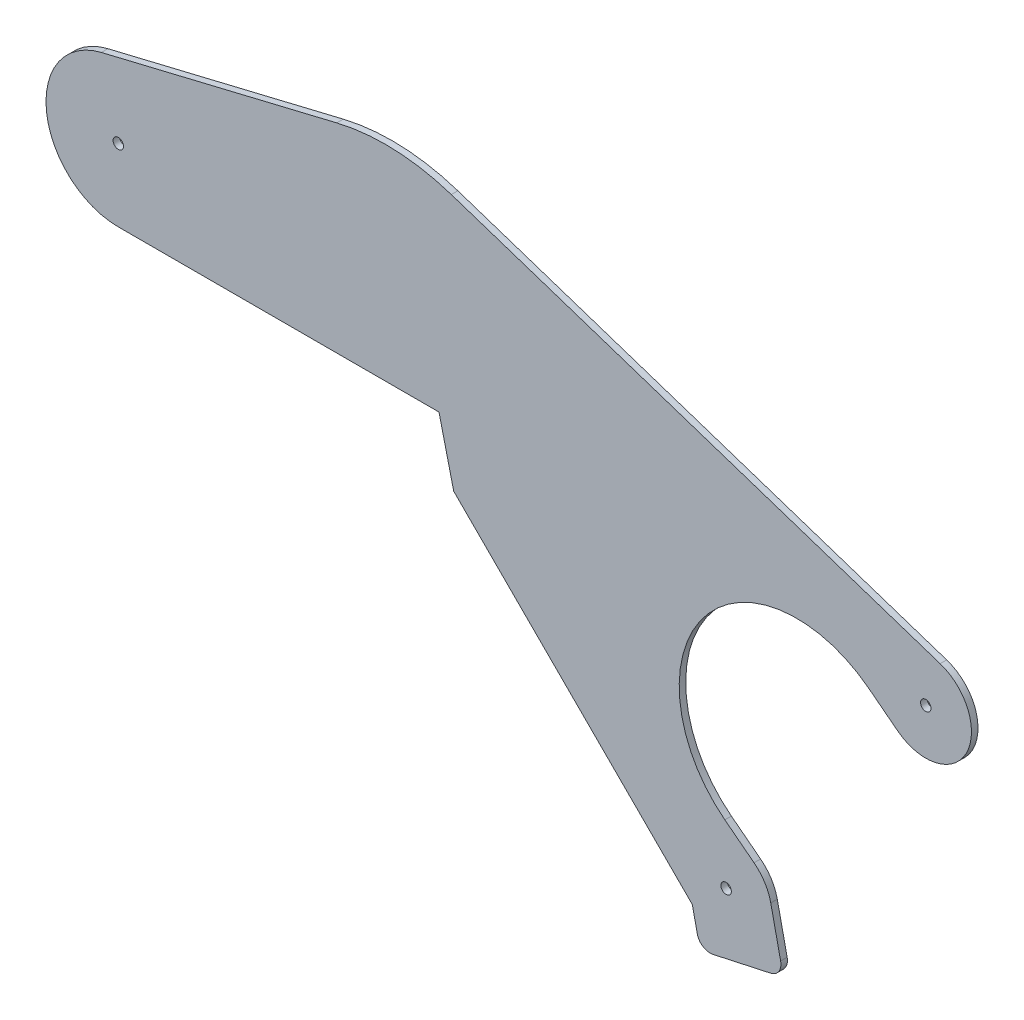
ISO-10303-21;
HEADER;
FILE_DESCRIPTION(('STEP AP214'),'2;1');
FILE_NAME('part.step','',(''),(''),'','','');
FILE_SCHEMA(('AUTOMOTIVE_DESIGN { 1 0 10303 214 1 1 1 1 }'));
ENDSEC;
DATA;
#1=APPLICATION_CONTEXT('core data for automotive mechanical design processes');
#2=APPLICATION_PROTOCOL_DEFINITION('international standard','automotive_design',2000,#1);
#3=PRODUCT_CONTEXT('',#1,'mechanical');
#4=PRODUCT('Part','Part','',(#3));
#5=PRODUCT_RELATED_PRODUCT_CATEGORY('part','',(#4));
#6=PRODUCT_DEFINITION_FORMATION('','',#4);
#7=PRODUCT_DEFINITION_CONTEXT('part definition',#1,'design');
#8=PRODUCT_DEFINITION('design','',#6,#7);
#9=PRODUCT_DEFINITION_SHAPE('','',#8);
#10=(LENGTH_UNIT() NAMED_UNIT(*) SI_UNIT(.MILLI.,.METRE.));
#11=(NAMED_UNIT(*) PLANE_ANGLE_UNIT() SI_UNIT($,.RADIAN.));
#12=(NAMED_UNIT(*) SI_UNIT($,.STERADIAN.) SOLID_ANGLE_UNIT());
#13=UNCERTAINTY_MEASURE_WITH_UNIT(LENGTH_MEASURE(1.E-05),#10,'distance_accuracy_value','');
#14=(GEOMETRIC_REPRESENTATION_CONTEXT(3) GLOBAL_UNCERTAINTY_ASSIGNED_CONTEXT((#13)) GLOBAL_UNIT_ASSIGNED_CONTEXT((#10,
#11,#12)) REPRESENTATION_CONTEXT('',''));
#15=CARTESIAN_POINT('',(0.,0.,0.));
#16=DIRECTION('',(0.,0.,1.));
#17=DIRECTION('',(1.,0.,0.));
#18=AXIS2_PLACEMENT_3D('',#15,#16,#17);
#19=CARTESIAN_POINT('',(295.571537134259,49.9390985922286,3.175));
#20=DIRECTION('',(0.,0.,1.));
#21=DIRECTION('',(1.,0.,0.));
#22=AXIS2_PLACEMENT_3D('',#19,#20,#21);
#23=PLANE('',#22);
#24=CARTESIAN_POINT('',(0.,215.9,3.175));
#25=DIRECTION('',(0.,0.,1.));
#26=DIRECTION('',(1.,0.,0.));
#27=AXIS2_PLACEMENT_3D('',#24,#25,#26);
#28=CIRCLE('',#27,2.54000000000001);
#29=CARTESIAN_POINT('',(2.54000000000001,215.9,3.175));
#30=VERTEX_POINT('',#29);
#31=EDGE_CURVE('E415',#30,#30,#28,.T.);
#32=ORIENTED_EDGE('',*,*,#31,.F.);
#33=EDGE_LOOP('',(#32));
#34=FACE_BOUND('',#33,.T.);
#35=CARTESIAN_POINT('',(295.571537134259,49.9390985922286,3.175));
#36=DIRECTION('',(0.,0.,1.));
#37=DIRECTION('',(1.,0.,0.));
#38=AXIS2_PLACEMENT_3D('',#35,#36,#37);
#39=CIRCLE('',#38,22.2249999999999);
#40=CARTESIAN_POINT('',(317.287210274764,54.6698665060856,3.175));
#41=VERTEX_POINT('',#40);
#42=CARTESIAN_POINT('',(309.165828872801,67.5216426950431,3.175));
#43=VERTEX_POINT('',#42);
#44=EDGE_CURVE('E253',#41,#43,#39,.T.);
#45=ORIENTED_EDGE('',*,*,#44,.T.);
#46=DIRECTION('',(-0.791115595177258,0.611666669900635,0.));
#47=VECTOR('',#46,1.);
#48=CARTESIAN_POINT('',(309.165828872801,67.5216426950431,3.175));
#49=LINE('',#48,#47);
#50=CARTESIAN_POINT('',(294.956987540673,78.5074894079018,3.175));
#51=VERTEX_POINT('',#50);
#52=EDGE_CURVE('E133',#43,#51,#49,.T.);
#53=ORIENTED_EDGE('',*,*,#52,.T.);
#54=CARTESIAN_POINT('',(329.913737725494,123.719745672282,3.175));
#55=DIRECTION('',(0.,0.,-1.));
#56=DIRECTION('',(-1.,0.,0.));
#57=AXIS2_PLACEMENT_3D('',#54,#55,#56);
#58=CIRCLE('',#57,57.15);
#59=CARTESIAN_POINT('',(364.870487910316,168.932001936662,3.175));
#60=VERTEX_POINT('',#59);
#61=EDGE_CURVE('E310',#51,#60,#58,.T.);
#62=ORIENTED_EDGE('',*,*,#61,.T.);
#63=DIRECTION('',(0.791115595177258,-0.611666669900635,0.));
#64=VECTOR('',#63,1.);
#65=CARTESIAN_POINT('',(364.870487910316,168.932001936662,3.175));
#66=LINE('',#65,#64);
#67=CARTESIAN_POINT('',(379.079329242443,157.946155223804,3.175));
#68=VERTEX_POINT('',#67);
#69=EDGE_CURVE('E330',#60,#68,#66,.T.);
#70=ORIENTED_EDGE('',*,*,#69,.T.);
#71=CARTESIAN_POINT('',(392.673620980985,175.528699326618,3.175));
#72=DIRECTION('',(0.,0.,1.));
#73=DIRECTION('',(1.,0.,0.));
#74=AXIS2_PLACEMENT_3D('',#71,#72,#73);
#75=CIRCLE('',#74,22.2250000000002);
#76=CARTESIAN_POINT('',(399.659420331189,196.627259287874,3.175));
#77=VERTEX_POINT('',#76);
#78=EDGE_CURVE('E326',#68,#77,#75,.T.);
#79=ORIENTED_EDGE('',*,*,#78,.T.);
#80=DIRECTION('',(-0.949316533689792,0.314321680549081,0.));
#81=VECTOR('',#80,1.);
#82=CARTESIAN_POINT('',(161.950324223875,275.333486261341,3.175));
#83=LINE('',#82,#81);
#84=CARTESIAN_POINT('',(161.950324223875,275.333486261341,3.175));
#85=VERTEX_POINT('',#84);
#86=EDGE_CURVE('E329',#77,#85,#83,.T.);
#87=ORIENTED_EDGE('',*,*,#86,.T.);
#88=CARTESIAN_POINT('',(130.015241480089,178.882926438458,3.175));
#89=DIRECTION('',(0.,0.,1.));
#90=DIRECTION('',(-1.,0.,0.));
#91=AXIS2_PLACEMENT_3D('',#88,#89,#90);
#92=CIRCLE('',#91,101.6);
#93=CARTESIAN_POINT('',(106.22673095449,277.658767447146,3.175));
#94=VERTEX_POINT('',#93);
#95=EDGE_CURVE('E334',#85,#94,#92,.T.);
#96=ORIENTED_EDGE('',*,*,#95,.T.);
#97=DIRECTION('',(-0.972203159534325,-0.234138883125967,0.));
#98=VECTOR('',#97,1.);
#99=CARTESIAN_POINT('',(-8.23472555890414,250.092638571516,3.175));
#100=LINE('',#99,#98);
#101=CARTESIAN_POINT('',(-8.23472555890414,250.092638571516,3.175));
#102=VERTEX_POINT('',#101);
#103=EDGE_CURVE('E341',#94,#102,#100,.T.);
#104=ORIENTED_EDGE('',*,*,#103,.T.);
#105=CARTESIAN_POINT('',(0.,215.9,3.175));
#106=DIRECTION('',(0.,0.,1.));
#107=DIRECTION('',(1.,0.,0.));
#108=AXIS2_PLACEMENT_3D('',#105,#106,#107);
#109=CIRCLE('',#108,35.1702606972539);
#110=CARTESIAN_POINT('',(0.,180.729739302746,3.175));
#111=VERTEX_POINT('',#110);
#112=EDGE_CURVE('E344',#102,#111,#109,.T.);
#113=ORIENTED_EDGE('',*,*,#112,.T.);
#114=DIRECTION('',(1.,0.,0.));
#115=VECTOR('',#114,1.);
#116=CARTESIAN_POINT('',(0.,180.729739302746,3.175));
#117=LINE('',#116,#115);
#118=CARTESIAN_POINT('',(155.941245852293,180.729739302746,3.175));
#119=VERTEX_POINT('',#118);
#120=EDGE_CURVE('E347',#111,#119,#117,.T.);
#121=ORIENTED_EDGE('',*,*,#120,.T.);
#122=DIRECTION('',(0.234138883126223,-0.972203159534264,0.));
#123=VECTOR('',#122,1.);
#124=CARTESIAN_POINT('',(155.941245852293,180.729739302746,3.175));
#125=LINE('',#124,#123);
#126=CARTESIAN_POINT('',(163.107951031453,150.971788271293,3.175));
#127=VERTEX_POINT('',#126);
#128=EDGE_CURVE('E350',#119,#127,#125,.T.);
#129=ORIENTED_EDGE('',*,*,#128,.T.);
#130=DIRECTION('',(0.707106781186547,-0.707106781186548,0.));
#131=VECTOR('',#130,1.);
#132=CARTESIAN_POINT('',(163.107951031453,150.971788271293,3.175));
#133=LINE('',#132,#131);
#134=CARTESIAN_POINT('',(279.140387861661,34.939351441085,3.175));
#135=VERTEX_POINT('',#134);
#136=EDGE_CURVE('E353',#127,#135,#133,.T.);
#137=ORIENTED_EDGE('',*,*,#136,.T.);
#138=DIRECTION('',(0.21285794887996,-0.977083155928203,0.));
#139=VECTOR('',#138,1.);
#140=CARTESIAN_POINT('',(279.140387861661,34.939351441085,3.175));
#141=LINE('',#140,#139);
#142=CARTESIAN_POINT('',(281.571044282355,23.781894277723,3.175));
#143=VERTEX_POINT('',#142);
#144=EDGE_CURVE('E356',#135,#143,#141,.T.);
#145=ORIENTED_EDGE('',*,*,#144,.T.);
#146=CARTESIAN_POINT('',(287.775522322499,25.1335422531107,3.175));
#147=DIRECTION('',(0.,0.,1.));
#148=DIRECTION('',(1.,0.,0.));
#149=AXIS2_PLACEMENT_3D('',#146,#147,#148);
#150=CIRCLE('',#149,6.34999999999993);
#151=CARTESIAN_POINT('',(289.127170297887,18.9290642129667,3.175));
#152=VERTEX_POINT('',#151);
#153=EDGE_CURVE('E179',#143,#152,#150,.T.);
#154=ORIENTED_EDGE('',*,*,#153,.T.);
#155=DIRECTION('',(0.977083155928205,0.212857948879947,0.));
#156=VECTOR('',#155,1.);
#157=CARTESIAN_POINT('',(289.127170297887,18.9290642129667,3.175));
#158=LINE('',#157,#156);
#159=CARTESIAN_POINT('',(317.240211958058,25.0535013688563,3.175));
#160=VERTEX_POINT('',#159);
#161=EDGE_CURVE('E173',#152,#160,#158,.T.);
#162=ORIENTED_EDGE('',*,*,#161,.T.);
#163=CARTESIAN_POINT('',(315.888563982671,31.2579794090003,3.175));
#164=DIRECTION('',(0.,0.,1.));
#165=DIRECTION('',(1.,0.,0.));
#166=AXIS2_PLACEMENT_3D('',#163,#164,#165);
#167=CIRCLE('',#166,6.34999999999997);
#168=CARTESIAN_POINT('',(322.093042022815,32.6096273843879,3.175));
#169=VERTEX_POINT('',#168);
#170=EDGE_CURVE('E177',#160,#169,#167,.T.);
#171=ORIENTED_EDGE('',*,*,#170,.T.);
#172=DIRECTION('',(-0.212857948879952,0.977083155928204,0.));
#173=VECTOR('',#172,1.);
#174=CARTESIAN_POINT('',(322.093042022815,32.6096273843879,3.175));
#175=LINE('',#174,#173);
#176=EDGE_CURVE('E63',#169,#41,#175,.T.);
#177=ORIENTED_EDGE('',*,*,#176,.T.);
#178=EDGE_LOOP('',(#45,#53,#62,#70,#79,#87,#96,#104,#113,#121,#129,#137,#145,#154,#162,#171,#177));
#179=FACE_BOUND('',#178,.T.);
#180=CARTESIAN_POINT('',(295.571537134259,49.9390985922286,3.175));
#181=DIRECTION('',(0.,0.,1.));
#182=DIRECTION('',(1.,0.,0.));
#183=AXIS2_PLACEMENT_3D('',#180,#181,#182);
#184=CIRCLE('',#183,2.54000000000053);
#185=CARTESIAN_POINT('',(298.11153713426,49.9390985922286,3.175));
#186=VERTEX_POINT('',#185);
#187=EDGE_CURVE('E206',#186,#186,#184,.T.);
#188=ORIENTED_EDGE('',*,*,#187,.F.);
#189=EDGE_LOOP('',(#188));
#190=FACE_BOUND('',#189,.T.);
#191=CARTESIAN_POINT('',(392.673620980985,175.528699326618,3.175));
#192=DIRECTION('',(0.,0.,1.));
#193=DIRECTION('',(1.,0.,0.));
#194=AXIS2_PLACEMENT_3D('',#191,#192,#193);
#195=CIRCLE('',#194,2.53999999999922);
#196=CARTESIAN_POINT('',(395.213620980984,175.528699326618,3.175));
#197=VERTEX_POINT('',#196);
#198=EDGE_CURVE('E404',#197,#197,#195,.T.);
#199=ORIENTED_EDGE('',*,*,#198,.F.);
#200=EDGE_LOOP('',(#199));
#201=FACE_BOUND('',#200,.T.);
#202=ADVANCED_FACE('F45',(#34,#179,#190,#201),#23,.T.);
#203=CARTESIAN_POINT('',(295.571537134259,49.9390985922286,0.));
#204=DIRECTION('',(0.,0.,1.));
#205=DIRECTION('',(1.,0.,0.));
#206=AXIS2_PLACEMENT_3D('',#203,#204,#205);
#207=PLANE('',#206);
#208=CARTESIAN_POINT('',(295.571537134259,49.9390985922286,0.));
#209=DIRECTION('',(0.,0.,1.));
#210=DIRECTION('',(1.,0.,0.));
#211=AXIS2_PLACEMENT_3D('',#208,#209,#210);
#212=CIRCLE('',#211,22.2249999999999);
#213=CARTESIAN_POINT('',(317.287210274764,54.6698665060856,0.));
#214=VERTEX_POINT('',#213);
#215=CARTESIAN_POINT('',(309.165828872801,67.5216426950431,0.));
#216=VERTEX_POINT('',#215);
#217=EDGE_CURVE('E201',#214,#216,#212,.T.);
#218=ORIENTED_EDGE('',*,*,#217,.F.);
#219=DIRECTION('',(-0.212857948879952,0.977083155928204,0.));
#220=VECTOR('',#219,1.);
#221=CARTESIAN_POINT('',(322.093042022815,32.6096273843879,0.));
#222=LINE('',#221,#220);
#223=CARTESIAN_POINT('',(322.093042022815,32.6096273843879,0.));
#224=VERTEX_POINT('',#223);
#225=EDGE_CURVE('E125',#224,#214,#222,.T.);
#226=ORIENTED_EDGE('',*,*,#225,.F.);
#227=CARTESIAN_POINT('',(315.888563982671,31.2579794090003,0.));
#228=DIRECTION('',(0.,0.,1.));
#229=DIRECTION('',(1.,0.,0.));
#230=AXIS2_PLACEMENT_3D('',#227,#228,#229);
#231=CIRCLE('',#230,6.34999999999997);
#232=CARTESIAN_POINT('',(317.240211958058,25.0535013688563,0.));
#233=VERTEX_POINT('',#232);
#234=EDGE_CURVE('E119',#233,#224,#231,.T.);
#235=ORIENTED_EDGE('',*,*,#234,.F.);
#236=DIRECTION('',(0.977083155928205,0.212857948879947,0.));
#237=VECTOR('',#236,1.);
#238=CARTESIAN_POINT('',(289.127170297887,18.9290642129667,0.));
#239=LINE('',#238,#237);
#240=CARTESIAN_POINT('',(289.127170297887,18.9290642129667,0.));
#241=VERTEX_POINT('',#240);
#242=EDGE_CURVE('E188',#241,#233,#239,.T.);
#243=ORIENTED_EDGE('',*,*,#242,.F.);
#244=CARTESIAN_POINT('',(287.775522322499,25.1335422531107,0.));
#245=DIRECTION('',(0.,0.,1.));
#246=DIRECTION('',(1.,0.,0.));
#247=AXIS2_PLACEMENT_3D('',#244,#245,#246);
#248=CIRCLE('',#247,6.34999999999993);
#249=CARTESIAN_POINT('',(281.571044282355,23.781894277723,0.));
#250=VERTEX_POINT('',#249);
#251=EDGE_CURVE('E244',#250,#241,#248,.T.);
#252=ORIENTED_EDGE('',*,*,#251,.F.);
#253=DIRECTION('',(0.21285794887996,-0.977083155928203,0.));
#254=VECTOR('',#253,1.);
#255=CARTESIAN_POINT('',(279.140387861661,34.939351441085,0.));
#256=LINE('',#255,#254);
#257=CARTESIAN_POINT('',(279.140387861661,34.939351441085,0.));
#258=VERTEX_POINT('',#257);
#259=EDGE_CURVE('E241',#258,#250,#256,.T.);
#260=ORIENTED_EDGE('',*,*,#259,.F.);
#261=DIRECTION('',(0.707106781186549,-0.707106781186546,0.));
#262=VECTOR('',#261,1.);
#263=CARTESIAN_POINT('',(267.156088922388,46.9236503803579,0.));
#264=LINE('',#263,#262);
#265=CARTESIAN_POINT('',(163.107951031453,150.971788271293,0.));
#266=VERTEX_POINT('',#265);
#267=EDGE_CURVE('E238',#266,#258,#264,.T.);
#268=ORIENTED_EDGE('',*,*,#267,.F.);
#269=DIRECTION('',(0.234138883126223,-0.972203159534264,0.));
#270=VECTOR('',#269,1.);
#271=CARTESIAN_POINT('',(155.941245852293,180.729739302746,0.));
#272=LINE('',#271,#270);
#273=CARTESIAN_POINT('',(155.941245852293,180.729739302746,0.));
#274=VERTEX_POINT('',#273);
#275=EDGE_CURVE('E234',#274,#266,#272,.T.);
#276=ORIENTED_EDGE('',*,*,#275,.F.);
#277=DIRECTION('',(1.,0.,0.));
#278=VECTOR('',#277,1.);
#279=CARTESIAN_POINT('',(91.265902062906,180.729739302746,0.));
#280=LINE('',#279,#278);
#281=CARTESIAN_POINT('',(0.,180.729739302746,0.));
#282=VERTEX_POINT('',#281);
#283=EDGE_CURVE('E231',#282,#274,#280,.T.);
#284=ORIENTED_EDGE('',*,*,#283,.F.);
#285=CARTESIAN_POINT('',(0.,215.9,0.));
#286=DIRECTION('',(0.,0.,1.));
#287=DIRECTION('',(1.,0.,0.));
#288=AXIS2_PLACEMENT_3D('',#285,#286,#287);
#289=CIRCLE('',#288,35.1702606972539);
#290=CARTESIAN_POINT('',(-8.23472555890414,250.092638571516,0.));
#291=VERTEX_POINT('',#290);
#292=EDGE_CURVE('E227',#291,#282,#289,.T.);
#293=ORIENTED_EDGE('',*,*,#292,.F.);
#294=DIRECTION('',(-0.972203159534325,-0.234138883125967,0.));
#295=VECTOR('',#294,1.);
#296=CARTESIAN_POINT('',(-8.23472555890414,250.092638571516,0.));
#297=LINE('',#296,#295);
#298=CARTESIAN_POINT('',(106.22673095449,277.658767447146,0.));
#299=VERTEX_POINT('',#298);
#300=EDGE_CURVE('E224',#299,#291,#297,.T.);
#301=ORIENTED_EDGE('',*,*,#300,.F.);
#302=CARTESIAN_POINT('',(130.015241480089,178.882926438458,0.));
#303=DIRECTION('',(0.,0.,1.));
#304=DIRECTION('',(-1.,0.,0.));
#305=AXIS2_PLACEMENT_3D('',#302,#303,#304);
#306=CIRCLE('',#305,101.6);
#307=CARTESIAN_POINT('',(161.950324223875,275.333486261341,0.));
#308=VERTEX_POINT('',#307);
#309=EDGE_CURVE('E221',#308,#299,#306,.T.);
#310=ORIENTED_EDGE('',*,*,#309,.F.);
#311=DIRECTION('',(-0.949316533689792,0.314321680549081,0.));
#312=VECTOR('',#311,1.);
#313=CARTESIAN_POINT('',(161.950324223875,275.333486261341,0.));
#314=LINE('',#313,#312);
#315=CARTESIAN_POINT('',(399.659420331189,196.627259287874,0.));
#316=VERTEX_POINT('',#315);
#317=EDGE_CURVE('E218',#316,#308,#314,.T.);
#318=ORIENTED_EDGE('',*,*,#317,.F.);
#319=CARTESIAN_POINT('',(392.673620980985,175.528699326618,0.));
#320=DIRECTION('',(0.,0.,1.));
#321=DIRECTION('',(1.,0.,0.));
#322=AXIS2_PLACEMENT_3D('',#319,#320,#321);
#323=CIRCLE('',#322,22.2250000000002);
#324=CARTESIAN_POINT('',(379.079329242443,157.946155223804,0.));
#325=VERTEX_POINT('',#324);
#326=EDGE_CURVE('E215',#325,#316,#323,.T.);
#327=ORIENTED_EDGE('',*,*,#326,.F.);
#328=DIRECTION('',(0.791115595177258,-0.611666669900635,0.));
#329=VECTOR('',#328,1.);
#330=CARTESIAN_POINT('',(364.870487910316,168.932001936662,0.));
#331=LINE('',#330,#329);
#332=CARTESIAN_POINT('',(364.870487910316,168.932001936662,0.));
#333=VERTEX_POINT('',#332);
#334=EDGE_CURVE('E212',#333,#325,#331,.T.);
#335=ORIENTED_EDGE('',*,*,#334,.F.);
#336=CARTESIAN_POINT('',(329.913737725494,123.719745672282,0.));
#337=DIRECTION('',(0.,0.,-1.));
#338=DIRECTION('',(-1.,0.,0.));
#339=AXIS2_PLACEMENT_3D('',#336,#337,#338);
#340=CIRCLE('',#339,57.15);
#341=CARTESIAN_POINT('',(294.956987540673,78.5074894079018,0.));
#342=VERTEX_POINT('',#341);
#343=EDGE_CURVE('E209',#342,#333,#340,.T.);
#344=ORIENTED_EDGE('',*,*,#343,.F.);
#345=DIRECTION('',(-0.791115595177258,0.611666669900635,0.));
#346=VECTOR('',#345,1.);
#347=CARTESIAN_POINT('',(309.165828872801,67.5216426950431,0.));
#348=LINE('',#347,#346);
#349=EDGE_CURVE('E205',#216,#342,#348,.T.);
#350=ORIENTED_EDGE('',*,*,#349,.F.);
#351=EDGE_LOOP('',(#218,#226,#235,#243,#252,#260,#268,#276,#284,#293,#301,#310,#318,#327,#335,
#344,#350));
#352=FACE_BOUND('',#351,.T.);
#353=CARTESIAN_POINT('',(295.571537134259,49.9390985922286,0.));
#354=DIRECTION('',(0.,0.,1.));
#355=DIRECTION('',(1.,0.,0.));
#356=AXIS2_PLACEMENT_3D('',#353,#354,#355);
#357=CIRCLE('',#356,2.54000000000053);
#358=CARTESIAN_POINT('',(298.11153713426,49.9390985922286,0.));
#359=VERTEX_POINT('',#358);
#360=EDGE_CURVE('E419',#359,#359,#357,.T.);
#361=ORIENTED_EDGE('',*,*,#360,.T.);
#362=EDGE_LOOP('',(#361));
#363=FACE_BOUND('',#362,.T.);
#364=CARTESIAN_POINT('',(0.,215.9,0.));
#365=DIRECTION('',(0.,0.,1.));
#366=DIRECTION('',(1.,0.,0.));
#367=AXIS2_PLACEMENT_3D('',#364,#365,#366);
#368=CIRCLE('',#367,2.54000000000001);
#369=CARTESIAN_POINT('',(2.54000000000001,215.9,0.));
#370=VERTEX_POINT('',#369);
#371=EDGE_CURVE('E412',#370,#370,#368,.T.);
#372=ORIENTED_EDGE('',*,*,#371,.T.);
#373=EDGE_LOOP('',(#372));
#374=FACE_BOUND('',#373,.T.);
#375=CARTESIAN_POINT('',(392.673620980985,175.528699326618,0.));
#376=DIRECTION('',(0.,0.,1.));
#377=DIRECTION('',(1.,0.,0.));
#378=AXIS2_PLACEMENT_3D('',#375,#376,#377);
#379=CIRCLE('',#378,2.53999999999922);
#380=CARTESIAN_POINT('',(395.213620980984,175.528699326618,0.));
#381=VERTEX_POINT('',#380);
#382=EDGE_CURVE('E407',#381,#381,#379,.T.);
#383=ORIENTED_EDGE('',*,*,#382,.T.);
#384=EDGE_LOOP('',(#383));
#385=FACE_BOUND('',#384,.T.);
#386=ADVANCED_FACE('F314',(#352,#363,#374,#385),#207,.F.);
#387=CARTESIAN_POINT('',(295.571537134259,49.9390985922286,3.175));
#388=DIRECTION('',(0.,0.,-1.));
#389=DIRECTION('',(-1.,0.,0.));
#390=AXIS2_PLACEMENT_3D('',#387,#388,#389);
#391=CYLINDRICAL_SURFACE('',#390,22.2249999999999);
#392=ORIENTED_EDGE('',*,*,#217,.T.);
#393=DIRECTION('',(0.,0.,-1.));
#394=VECTOR('',#393,1.);
#395=CARTESIAN_POINT('',(309.165828872801,67.5216426950431,3.175));
#396=LINE('',#395,#394);
#397=EDGE_CURVE('E11',#43,#216,#396,.T.);
#398=ORIENTED_EDGE('',*,*,#397,.F.);
#399=ORIENTED_EDGE('',*,*,#44,.F.);
#400=DIRECTION('',(0.,0.,-1.));
#401=VECTOR('',#400,1.);
#402=CARTESIAN_POINT('',(317.287210274764,54.6698665060856,3.175));
#403=LINE('',#402,#401);
#404=EDGE_CURVE('E197',#41,#214,#403,.T.);
#405=ORIENTED_EDGE('',*,*,#404,.T.);
#406=EDGE_LOOP('',(#392,#398,#399,#405));
#407=FACE_BOUND('',#406,.T.);
#408=ADVANCED_FACE('F47',(#407),#391,.T.);
#409=CARTESIAN_POINT('',(309.165828872801,67.5216426950431,3.175));
#410=DIRECTION('',(-0.611666669900635,-0.791115595177258,0.));
#411=DIRECTION('',(0.791115595177258,-0.611666669900635,0.));
#412=AXIS2_PLACEMENT_3D('',#409,#410,#411);
#413=PLANE('',#412);
#414=ORIENTED_EDGE('',*,*,#349,.T.);
#415=DIRECTION('',(0.,0.,-1.));
#416=VECTOR('',#415,1.);
#417=CARTESIAN_POINT('',(294.956987540673,78.5074894079018,3.175));
#418=LINE('',#417,#416);
#419=EDGE_CURVE('E55',#51,#342,#418,.T.);
#420=ORIENTED_EDGE('',*,*,#419,.F.);
#421=ORIENTED_EDGE('',*,*,#52,.F.);
#422=ORIENTED_EDGE('',*,*,#397,.T.);
#423=EDGE_LOOP('',(#414,#420,#421,#422));
#424=FACE_BOUND('',#423,.T.);
#425=ADVANCED_FACE('F572',(#424),#413,.F.);
#426=CARTESIAN_POINT('',(329.913737725494,123.719745672282,3.175));
#427=DIRECTION('',(0.,0.,-1.));
#428=DIRECTION('',(-1.,0.,0.));
#429=AXIS2_PLACEMENT_3D('',#426,#427,#428);
#430=CYLINDRICAL_SURFACE('',#429,57.15);
#431=ORIENTED_EDGE('',*,*,#343,.T.);
#432=DIRECTION('',(0.,0.,-1.));
#433=VECTOR('',#432,1.);
#434=CARTESIAN_POINT('',(364.870487910316,168.932001936662,3.175));
#435=LINE('',#434,#433);
#436=EDGE_CURVE('E300',#60,#333,#435,.T.);
#437=ORIENTED_EDGE('',*,*,#436,.F.);
#438=ORIENTED_EDGE('',*,*,#61,.F.);
#439=ORIENTED_EDGE('',*,*,#419,.T.);
#440=EDGE_LOOP('',(#431,#437,#438,#439));
#441=FACE_BOUND('',#440,.T.);
#442=ADVANCED_FACE('F308',(#441),#430,.F.);
#443=CARTESIAN_POINT('',(364.870487910316,168.932001936662,3.175));
#444=DIRECTION('',(0.611666669900636,0.791115595177258,0.));
#445=DIRECTION('',(-0.791115595177258,0.611666669900636,0.));
#446=AXIS2_PLACEMENT_3D('',#443,#444,#445);
#447=PLANE('',#446);
#448=ORIENTED_EDGE('',*,*,#334,.T.);
#449=DIRECTION('',(0.,0.,-1.));
#450=VECTOR('',#449,1.);
#451=CARTESIAN_POINT('',(379.079329242443,157.946155223804,3.175));
#452=LINE('',#451,#450);
#453=EDGE_CURVE('E296',#68,#325,#452,.T.);
#454=ORIENTED_EDGE('',*,*,#453,.F.);
#455=ORIENTED_EDGE('',*,*,#69,.F.);
#456=ORIENTED_EDGE('',*,*,#436,.T.);
#457=EDGE_LOOP('',(#448,#454,#455,#456));
#458=FACE_BOUND('',#457,.T.);
#459=ADVANCED_FACE('F320',(#458),#447,.F.);
#460=CARTESIAN_POINT('',(392.673620980985,175.528699326618,3.175));
#461=DIRECTION('',(0.,0.,-1.));
#462=DIRECTION('',(-1.,0.,0.));
#463=AXIS2_PLACEMENT_3D('',#460,#461,#462);
#464=CYLINDRICAL_SURFACE('',#463,22.2250000000002);
#465=ORIENTED_EDGE('',*,*,#326,.T.);
#466=DIRECTION('',(0.,0.,-1.));
#467=VECTOR('',#466,1.);
#468=CARTESIAN_POINT('',(399.659420331189,196.627259287874,3.175));
#469=LINE('',#468,#467);
#470=EDGE_CURVE('E292',#77,#316,#469,.T.);
#471=ORIENTED_EDGE('',*,*,#470,.F.);
#472=ORIENTED_EDGE('',*,*,#78,.F.);
#473=ORIENTED_EDGE('',*,*,#453,.T.);
#474=EDGE_LOOP('',(#465,#471,#472,#473));
#475=FACE_BOUND('',#474,.T.);
#476=ADVANCED_FACE('F324',(#475),#464,.T.);
#477=CARTESIAN_POINT('',(161.950324223875,275.333486261341,3.175));
#478=DIRECTION('',(-0.314321680549081,-0.949316533689792,0.));
#479=DIRECTION('',(0.949316533689792,-0.314321680549081,0.));
#480=AXIS2_PLACEMENT_3D('',#477,#478,#479);
#481=PLANE('',#480);
#482=ORIENTED_EDGE('',*,*,#317,.T.);
#483=DIRECTION('',(0.,0.,-1.));
#484=VECTOR('',#483,1.);
#485=CARTESIAN_POINT('',(161.950324223875,275.333486261341,3.175));
#486=LINE('',#485,#484);
#487=EDGE_CURVE('E288',#85,#308,#486,.T.);
#488=ORIENTED_EDGE('',*,*,#487,.F.);
#489=ORIENTED_EDGE('',*,*,#86,.F.);
#490=ORIENTED_EDGE('',*,*,#470,.T.);
#491=EDGE_LOOP('',(#482,#488,#489,#490));
#492=FACE_BOUND('',#491,.T.);
#493=ADVANCED_FACE('F541',(#492),#481,.F.);
#494=CARTESIAN_POINT('',(130.015241480089,178.882926438458,3.175));
#495=DIRECTION('',(0.,0.,-1.));
#496=DIRECTION('',(-1.,0.,0.));
#497=AXIS2_PLACEMENT_3D('',#494,#495,#496);
#498=CYLINDRICAL_SURFACE('',#497,101.6);
#499=ORIENTED_EDGE('',*,*,#309,.T.);
#500=DIRECTION('',(0.,0.,-1.));
#501=VECTOR('',#500,1.);
#502=CARTESIAN_POINT('',(106.22673095449,277.658767447146,3.175));
#503=LINE('',#502,#501);
#504=EDGE_CURVE('E284',#94,#299,#503,.T.);
#505=ORIENTED_EDGE('',*,*,#504,.F.);
#506=ORIENTED_EDGE('',*,*,#95,.F.);
#507=ORIENTED_EDGE('',*,*,#487,.T.);
#508=EDGE_LOOP('',(#499,#505,#506,#507));
#509=FACE_BOUND('',#508,.T.);
#510=ADVANCED_FACE('F532',(#509),#498,.T.);
#511=CARTESIAN_POINT('',(-8.23472555890414,250.092638571516,3.175));
#512=DIRECTION('',(0.234138883125967,-0.972203159534325,0.));
#513=DIRECTION('',(0.972203159534325,0.234138883125967,0.));
#514=AXIS2_PLACEMENT_3D('',#511,#512,#513);
#515=PLANE('',#514);
#516=ORIENTED_EDGE('',*,*,#300,.T.);
#517=DIRECTION('',(0.,0.,-1.));
#518=VECTOR('',#517,1.);
#519=CARTESIAN_POINT('',(-8.23472555890414,250.092638571516,3.175));
#520=LINE('',#519,#518);
#521=EDGE_CURVE('E280',#102,#291,#520,.T.);
#522=ORIENTED_EDGE('',*,*,#521,.F.);
#523=ORIENTED_EDGE('',*,*,#103,.F.);
#524=ORIENTED_EDGE('',*,*,#504,.T.);
#525=EDGE_LOOP('',(#516,#522,#523,#524));
#526=FACE_BOUND('',#525,.T.);
#527=ADVANCED_FACE('F523',(#526),#515,.F.);
#528=CARTESIAN_POINT('',(0.,215.9,3.175));
#529=DIRECTION('',(0.,0.,-1.));
#530=DIRECTION('',(-1.,0.,0.));
#531=AXIS2_PLACEMENT_3D('',#528,#529,#530);
#532=CYLINDRICAL_SURFACE('',#531,35.1702606972539);
#533=ORIENTED_EDGE('',*,*,#292,.T.);
#534=DIRECTION('',(0.,0.,-1.));
#535=VECTOR('',#534,1.);
#536=CARTESIAN_POINT('',(0.,180.729739302746,3.175));
#537=LINE('',#536,#535);
#538=EDGE_CURVE('E276',#111,#282,#537,.T.);
#539=ORIENTED_EDGE('',*,*,#538,.F.);
#540=ORIENTED_EDGE('',*,*,#112,.F.);
#541=ORIENTED_EDGE('',*,*,#521,.T.);
#542=EDGE_LOOP('',(#533,#539,#540,#541));
#543=FACE_BOUND('',#542,.T.);
#544=ADVANCED_FACE('F514',(#543),#532,.T.);
#545=CARTESIAN_POINT('',(91.265902062906,180.729739302746,3.175));
#546=DIRECTION('',(0.,1.,0.));
#547=DIRECTION('',(0.,0.,1.));
#548=AXIS2_PLACEMENT_3D('',#545,#546,#547);
#549=PLANE('',#548);
#550=ORIENTED_EDGE('',*,*,#283,.T.);
#551=DIRECTION('',(0.,0.,-1.));
#552=VECTOR('',#551,1.);
#553=CARTESIAN_POINT('',(155.941245852293,180.729739302746,3.175));
#554=LINE('',#553,#552);
#555=EDGE_CURVE('E272',#119,#274,#554,.T.);
#556=ORIENTED_EDGE('',*,*,#555,.F.);
#557=ORIENTED_EDGE('',*,*,#120,.F.);
#558=ORIENTED_EDGE('',*,*,#538,.T.);
#559=EDGE_LOOP('',(#550,#556,#557,#558));
#560=FACE_BOUND('',#559,.T.);
#561=ADVANCED_FACE('F505',(#560),#549,.F.);
#562=CARTESIAN_POINT('',(155.941245852293,180.729739302746,3.175));
#563=DIRECTION('',(0.972203159534264,0.234138883126223,0.));
#564=DIRECTION('',(-0.234138883126223,0.972203159534264,0.));
#565=AXIS2_PLACEMENT_3D('',#562,#563,#564);
#566=PLANE('',#565);
#567=ORIENTED_EDGE('',*,*,#275,.T.);
#568=DIRECTION('',(0.,0.,-1.));
#569=VECTOR('',#568,1.);
#570=CARTESIAN_POINT('',(163.107951031453,150.971788271293,3.175));
#571=LINE('',#570,#569);
#572=EDGE_CURVE('E268',#127,#266,#571,.T.);
#573=ORIENTED_EDGE('',*,*,#572,.F.);
#574=ORIENTED_EDGE('',*,*,#128,.F.);
#575=ORIENTED_EDGE('',*,*,#555,.T.);
#576=EDGE_LOOP('',(#567,#573,#574,#575));
#577=FACE_BOUND('',#576,.T.);
#578=ADVANCED_FACE('F495',(#577),#566,.F.);
#579=CARTESIAN_POINT('',(267.156088922388,46.9236503803579,3.175));
#580=DIRECTION('',(0.707106781186546,0.707106781186549,0.));
#581=DIRECTION('',(-0.707106781186549,0.707106781186546,0.));
#582=AXIS2_PLACEMENT_3D('',#579,#580,#581);
#583=PLANE('',#582);
#584=ORIENTED_EDGE('',*,*,#267,.T.);
#585=DIRECTION('',(0.,0.,-1.));
#586=VECTOR('',#585,1.);
#587=CARTESIAN_POINT('',(279.140387861661,34.939351441085,3.175));
#588=LINE('',#587,#586);
#589=EDGE_CURVE('E264',#135,#258,#588,.T.);
#590=ORIENTED_EDGE('',*,*,#589,.F.);
#591=ORIENTED_EDGE('',*,*,#136,.F.);
#592=ORIENTED_EDGE('',*,*,#572,.T.);
#593=EDGE_LOOP('',(#584,#590,#591,#592));
#594=FACE_BOUND('',#593,.T.);
#595=ADVANCED_FACE('F486',(#594),#583,.F.);
#596=CARTESIAN_POINT('',(279.140387861661,34.939351441085,3.175));
#597=DIRECTION('',(0.977083155928203,0.21285794887996,0.));
#598=DIRECTION('',(-0.21285794887996,0.977083155928203,0.));
#599=AXIS2_PLACEMENT_3D('',#596,#597,#598);
#600=PLANE('',#599);
#601=ORIENTED_EDGE('',*,*,#259,.T.);
#602=DIRECTION('',(0.,0.,-1.));
#603=VECTOR('',#602,1.);
#604=CARTESIAN_POINT('',(281.571044282355,23.781894277723,3.175));
#605=LINE('',#604,#603);
#606=EDGE_CURVE('E260',#143,#250,#605,.T.);
#607=ORIENTED_EDGE('',*,*,#606,.F.);
#608=ORIENTED_EDGE('',*,*,#144,.F.);
#609=ORIENTED_EDGE('',*,*,#589,.T.);
#610=EDGE_LOOP('',(#601,#607,#608,#609));
#611=FACE_BOUND('',#610,.T.);
#612=ADVANCED_FACE('F364',(#611),#600,.F.);
#613=CARTESIAN_POINT('',(287.775522322499,25.1335422531107,3.175));
#614=DIRECTION('',(0.,0.,-1.));
#615=DIRECTION('',(-1.,0.,0.));
#616=AXIS2_PLACEMENT_3D('',#613,#614,#615);
#617=CYLINDRICAL_SURFACE('',#616,6.34999999999993);
#618=ORIENTED_EDGE('',*,*,#251,.T.);
#619=DIRECTION('',(0.,0.,-1.));
#620=VECTOR('',#619,1.);
#621=CARTESIAN_POINT('',(289.127170297887,18.9290642129667,3.175));
#622=LINE('',#621,#620);
#623=EDGE_CURVE('E190',#152,#241,#622,.T.);
#624=ORIENTED_EDGE('',*,*,#623,.F.);
#625=ORIENTED_EDGE('',*,*,#153,.F.);
#626=ORIENTED_EDGE('',*,*,#606,.T.);
#627=EDGE_LOOP('',(#618,#624,#625,#626));
#628=FACE_BOUND('',#627,.T.);
#629=ADVANCED_FACE('F368',(#628),#617,.T.);
#630=CARTESIAN_POINT('',(289.127170297887,18.9290642129667,3.175));
#631=DIRECTION('',(-0.212857948879947,0.977083155928205,0.));
#632=DIRECTION('',(-0.977083155928205,-0.212857948879947,0.));
#633=AXIS2_PLACEMENT_3D('',#630,#631,#632);
#634=PLANE('',#633);
#635=ORIENTED_EDGE('',*,*,#242,.T.);
#636=DIRECTION('',(0.,0.,-1.));
#637=VECTOR('',#636,1.);
#638=CARTESIAN_POINT('',(317.240211958058,25.0535013688563,3.175));
#639=LINE('',#638,#637);
#640=EDGE_CURVE('E185',#160,#233,#639,.T.);
#641=ORIENTED_EDGE('',*,*,#640,.F.);
#642=ORIENTED_EDGE('',*,*,#161,.F.);
#643=ORIENTED_EDGE('',*,*,#623,.T.);
#644=EDGE_LOOP('',(#635,#641,#642,#643));
#645=FACE_BOUND('',#644,.T.);
#646=ADVANCED_FACE('F186',(#645),#634,.F.);
#647=CARTESIAN_POINT('',(315.888563982671,31.2579794090003,3.175));
#648=DIRECTION('',(0.,0.,-1.));
#649=DIRECTION('',(-1.,0.,0.));
#650=AXIS2_PLACEMENT_3D('',#647,#648,#649);
#651=CYLINDRICAL_SURFACE('',#650,6.34999999999997);
#652=ORIENTED_EDGE('',*,*,#234,.T.);
#653=DIRECTION('',(0.,0.,-1.));
#654=VECTOR('',#653,1.);
#655=CARTESIAN_POINT('',(322.093042022815,32.6096273843879,3.175));
#656=LINE('',#655,#654);
#657=EDGE_CURVE('E191',#169,#224,#656,.T.);
#658=ORIENTED_EDGE('',*,*,#657,.F.);
#659=ORIENTED_EDGE('',*,*,#170,.F.);
#660=ORIENTED_EDGE('',*,*,#640,.T.);
#661=EDGE_LOOP('',(#652,#658,#659,#660));
#662=FACE_BOUND('',#661,.T.);
#663=ADVANCED_FACE('F193',(#662),#651,.T.);
#664=CARTESIAN_POINT('',(322.093042022815,32.6096273843879,3.175));
#665=DIRECTION('',(-0.977083155928204,-0.212857948879952,0.));
#666=DIRECTION('',(0.212857948879952,-0.977083155928204,0.));
#667=AXIS2_PLACEMENT_3D('',#664,#665,#666);
#668=PLANE('',#667);
#669=ORIENTED_EDGE('',*,*,#225,.T.);
#670=ORIENTED_EDGE('',*,*,#404,.F.);
#671=ORIENTED_EDGE('',*,*,#176,.F.);
#672=ORIENTED_EDGE('',*,*,#657,.T.);
#673=EDGE_LOOP('',(#669,#670,#671,#672));
#674=FACE_BOUND('',#673,.T.);
#675=ADVANCED_FACE('F372',(#674),#668,.F.);
#676=CARTESIAN_POINT('',(295.571537134259,49.9390985922286,3.175));
#677=DIRECTION('',(0.,0.,-1.));
#678=DIRECTION('',(-1.,0.,0.));
#679=AXIS2_PLACEMENT_3D('',#676,#677,#678);
#680=CYLINDRICAL_SURFACE('',#679,2.54000000000053);
#681=ORIENTED_EDGE('',*,*,#187,.T.);
#682=EDGE_LOOP('',(#681));
#683=FACE_BOUND('',#682,.T.);
#684=ORIENTED_EDGE('',*,*,#360,.F.);
#685=EDGE_LOOP('',(#684));
#686=FACE_BOUND('',#685,.T.);
#687=ADVANCED_FACE('F374',(#683,#686),#680,.F.);
#688=CARTESIAN_POINT('',(0.,215.9,3.175));
#689=DIRECTION('',(0.,0.,-1.));
#690=DIRECTION('',(-1.,0.,0.));
#691=AXIS2_PLACEMENT_3D('',#688,#689,#690);
#692=CYLINDRICAL_SURFACE('',#691,2.54000000000001);
#693=ORIENTED_EDGE('',*,*,#31,.T.);
#694=EDGE_LOOP('',(#693));
#695=FACE_BOUND('',#694,.T.);
#696=ORIENTED_EDGE('',*,*,#371,.F.);
#697=EDGE_LOOP('',(#696));
#698=FACE_BOUND('',#697,.T.);
#699=ADVANCED_FACE('F380',(#695,#698),#692,.F.);
#700=CARTESIAN_POINT('',(392.673620980985,175.528699326618,3.175));
#701=DIRECTION('',(0.,0.,-1.));
#702=DIRECTION('',(-1.,0.,0.));
#703=AXIS2_PLACEMENT_3D('',#700,#701,#702);
#704=CYLINDRICAL_SURFACE('',#703,2.53999999999922);
#705=ORIENTED_EDGE('',*,*,#198,.T.);
#706=EDGE_LOOP('',(#705));
#707=FACE_BOUND('',#706,.T.);
#708=ORIENTED_EDGE('',*,*,#382,.F.);
#709=EDGE_LOOP('',(#708));
#710=FACE_BOUND('',#709,.T.);
#711=ADVANCED_FACE('F395',(#707,#710),#704,.F.);
#712=CLOSED_SHELL('',(#202,#386,#408,#425,#442,#459,#476,#493,#510,#527,#544,#561,#578,#595,
#612,#629,#646,#663,#675,#687,#699,#711));
#713=MANIFOLD_SOLID_BREP('B2',#712);
#714=ADVANCED_BREP_SHAPE_REPRESENTATION('',(#18,#713),#14);
#715=SHAPE_DEFINITION_REPRESENTATION(#9,#714);
ENDSEC;
END-ISO-10303-21;
